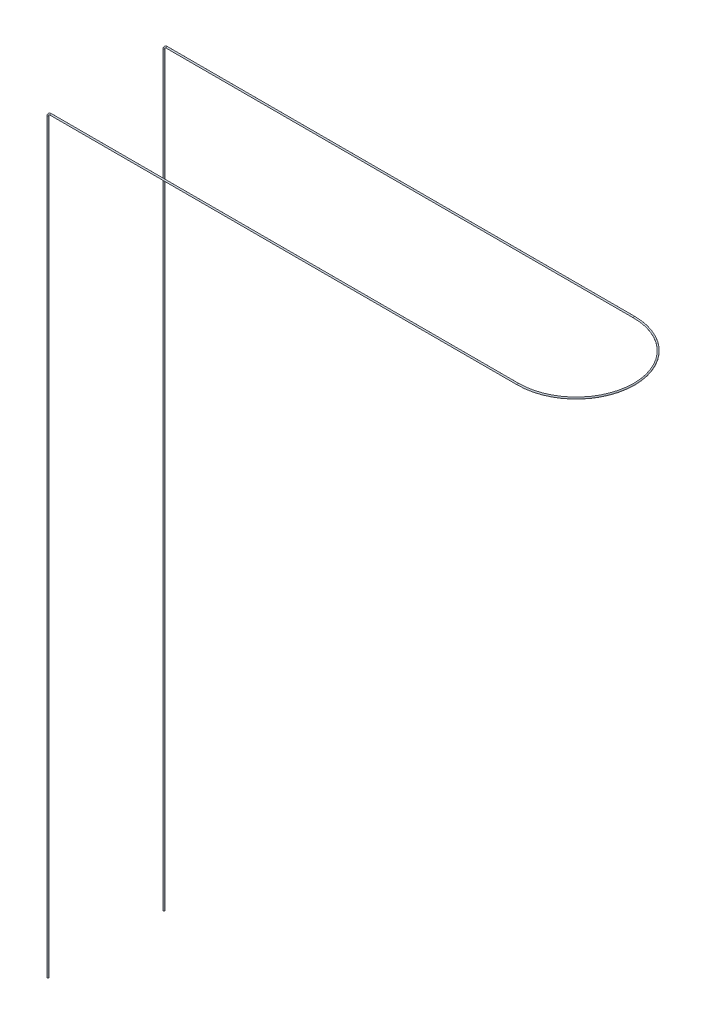
ISO-10303-21;
HEADER;
FILE_DESCRIPTION(('STEP AP214'),'2;1');
FILE_NAME('part.step','',(''),(''),'','','');
FILE_SCHEMA(('AUTOMOTIVE_DESIGN { 1 0 10303 214 1 1 1 1 }'));
ENDSEC;
DATA;
#1=APPLICATION_CONTEXT('core data for automotive mechanical design processes');
#2=APPLICATION_PROTOCOL_DEFINITION('international standard','automotive_design',2000,#1);
#3=PRODUCT_CONTEXT('',#1,'mechanical');
#4=PRODUCT('Part','Part','',(#3));
#5=PRODUCT_RELATED_PRODUCT_CATEGORY('part','',(#4));
#6=PRODUCT_DEFINITION_FORMATION('','',#4);
#7=PRODUCT_DEFINITION_CONTEXT('part definition',#1,'design');
#8=PRODUCT_DEFINITION('design','',#6,#7);
#9=PRODUCT_DEFINITION_SHAPE('','',#8);
#10=(LENGTH_UNIT() NAMED_UNIT(*) SI_UNIT(.MILLI.,.METRE.));
#11=(NAMED_UNIT(*) PLANE_ANGLE_UNIT() SI_UNIT($,.RADIAN.));
#12=(NAMED_UNIT(*) SI_UNIT($,.STERADIAN.) SOLID_ANGLE_UNIT());
#13=UNCERTAINTY_MEASURE_WITH_UNIT(LENGTH_MEASURE(1.E-05),#10,'distance_accuracy_value','');
#14=(GEOMETRIC_REPRESENTATION_CONTEXT(3) GLOBAL_UNCERTAINTY_ASSIGNED_CONTEXT((#13)) GLOBAL_UNIT_ASSIGNED_CONTEXT((#10,
#11,#12)) REPRESENTATION_CONTEXT('',''));
#15=CARTESIAN_POINT('',(0.,0.,0.));
#16=DIRECTION('',(0.,0.,1.));
#17=DIRECTION('',(1.,0.,0.));
#18=AXIS2_PLACEMENT_3D('',#15,#16,#17);
#19=CARTESIAN_POINT('',(0.,0.,0.));
#20=DIRECTION('',(0.,-1.,0.));
#21=DIRECTION('',(0.,0.,-1.));
#22=AXIS2_PLACEMENT_3D('',#19,#20,#21);
#23=PLANE('',#22);
#24=CARTESIAN_POINT('',(0.,0.,0.));
#25=DIRECTION('',(0.,-1.,0.));
#26=DIRECTION('',(0.,0.,-1.));
#27=AXIS2_PLACEMENT_3D('',#24,#25,#26);
#28=CIRCLE('',#27,0.25);
#29=CARTESIAN_POINT('',(0.,0.,-0.25));
#30=VERTEX_POINT('',#29);
#31=EDGE_CURVE('E85',#30,#30,#28,.T.);
#32=ORIENTED_EDGE('',*,*,#31,.T.);
#33=EDGE_LOOP('',(#32));
#34=FACE_BOUND('',#33,.T.);
#35=ADVANCED_FACE('F50',(#34),#23,.T.);
#36=CARTESIAN_POINT('',(0.,0.,-40.0000000000001));
#37=DIRECTION('',(0.,1.,0.));
#38=DIRECTION('',(0.,0.,1.));
#39=AXIS2_PLACEMENT_3D('',#36,#37,#38);
#40=PLANE('',#39);
#41=CARTESIAN_POINT('',(0.,0.,-40.0000000000001));
#42=DIRECTION('',(0.,1.,0.));
#43=DIRECTION('',(0.,0.,1.));
#44=AXIS2_PLACEMENT_3D('',#41,#42,#43);
#45=CIRCLE('',#44,0.25);
#46=CARTESIAN_POINT('',(0.,0.,-39.7500000000001));
#47=VERTEX_POINT('',#46);
#48=EDGE_CURVE('E11',#47,#47,#45,.T.);
#49=ORIENTED_EDGE('',*,*,#48,.F.);
#50=EDGE_LOOP('',(#49));
#51=FACE_BOUND('',#50,.T.);
#52=ADVANCED_FACE('F94',(#51),#40,.F.);
#53=CARTESIAN_POINT('',(0.,0.,0.));
#54=DIRECTION('',(0.,1.,0.));
#55=DIRECTION('',(-1.,0.,0.));
#56=AXIS2_PLACEMENT_3D('',#53,#54,#55);
#57=CYLINDRICAL_SURFACE('',#56,0.25);
#58=CARTESIAN_POINT('',(0.,257.,0.));
#59=DIRECTION('',(0.,-1.,0.));
#60=DIRECTION('',(0.,0.,-1.));
#61=AXIS2_PLACEMENT_3D('',#58,#59,#60);
#62=CIRCLE('',#61,0.25);
#63=CARTESIAN_POINT('',(-0.250000000000012,257.,0.));
#64=VERTEX_POINT('',#63);
#65=EDGE_CURVE('E81',#64,#64,#62,.T.);
#66=ORIENTED_EDGE('',*,*,#65,.T.);
#67=EDGE_LOOP('',(#66));
#68=FACE_BOUND('',#67,.T.);
#69=ORIENTED_EDGE('',*,*,#31,.F.);
#70=EDGE_LOOP('',(#69));
#71=FACE_BOUND('',#70,.T.);
#72=ADVANCED_FACE('F91',(#68,#71),#57,.T.);
#73=CARTESIAN_POINT('',(0.999999999999989,257.,0.));
#74=DIRECTION('',(0.,0.,-1.));
#75=DIRECTION('',(-1.,0.,0.));
#76=AXIS2_PLACEMENT_3D('',#73,#74,#75);
#77=TOROIDAL_SURFACE('',#76,1.,0.25);
#78=CARTESIAN_POINT('',(0.999999999999988,258.,0.));
#79=DIRECTION('',(-1.,0.,0.));
#80=DIRECTION('',(0.,0.,-1.));
#81=AXIS2_PLACEMENT_3D('',#78,#79,#80);
#82=CIRCLE('',#81,0.25);
#83=CARTESIAN_POINT('',(0.999999999999988,258.25,0.));
#84=VERTEX_POINT('',#83);
#85=EDGE_CURVE('E77',#84,#84,#82,.T.);
#86=CARTESIAN_POINT('',(0.999999999999989,257.,0.));
#87=DIRECTION('',(0.,0.,-1.));
#88=DIRECTION('',(-1.,0.,0.));
#89=AXIS2_PLACEMENT_3D('',#86,#87,#88);
#90=CIRCLE('',#89,1.25);
#91=EDGE_CURVE('',#64,#84,#90,.T.);
#92=ORIENTED_EDGE('',*,*,#65,.F.);
#93=ORIENTED_EDGE('',*,*,#85,.T.);
#94=ORIENTED_EDGE('',*,*,#91,.T.);
#95=ORIENTED_EDGE('',*,*,#91,.F.);
#96=EDGE_LOOP('',(#92,#94,#93,#95));
#97=FACE_BOUND('',#96,.T.);
#98=ADVANCED_FACE('F93',(#97),#77,.T.);
#99=CARTESIAN_POINT('',(0.999999999999989,258.,0.));
#100=DIRECTION('',(1.,0.,0.));
#101=DIRECTION('',(0.,1.,0.));
#102=AXIS2_PLACEMENT_3D('',#99,#100,#101);
#103=CYLINDRICAL_SURFACE('',#102,0.25);
#104=CARTESIAN_POINT('',(162.,258.,0.));
#105=DIRECTION('',(-1.,0.,0.));
#106=DIRECTION('',(0.,0.,-1.));
#107=AXIS2_PLACEMENT_3D('',#104,#105,#106);
#108=CIRCLE('',#107,0.25);
#109=CARTESIAN_POINT('',(162.,258.,0.249999999999993));
#110=VERTEX_POINT('',#109);
#111=EDGE_CURVE('E73',#110,#110,#108,.T.);
#112=ORIENTED_EDGE('',*,*,#111,.T.);
#113=EDGE_LOOP('',(#112));
#114=FACE_BOUND('',#113,.T.);
#115=ORIENTED_EDGE('',*,*,#85,.F.);
#116=EDGE_LOOP('',(#115));
#117=FACE_BOUND('',#116,.T.);
#118=ADVANCED_FACE('F101',(#114,#117),#103,.T.);
#119=CARTESIAN_POINT('',(162.,258.,-20.));
#120=DIRECTION('',(0.,1.,0.));
#121=DIRECTION('',(0.,0.,1.));
#122=AXIS2_PLACEMENT_3D('',#119,#120,#121);
#123=TOROIDAL_SURFACE('',#122,20.,0.25);
#124=CARTESIAN_POINT('',(162.,258.,-40.));
#125=DIRECTION('',(1.,0.,0.));
#126=DIRECTION('',(0.,0.,1.));
#127=AXIS2_PLACEMENT_3D('',#124,#125,#126);
#128=CIRCLE('',#127,0.25);
#129=CARTESIAN_POINT('',(162.,258.,-40.25));
#130=VERTEX_POINT('',#129);
#131=EDGE_CURVE('E67',#130,#130,#128,.T.);
#132=CARTESIAN_POINT('',(162.,258.,-20.));
#133=DIRECTION('',(0.,1.,0.));
#134=DIRECTION('',(0.,0.,1.));
#135=AXIS2_PLACEMENT_3D('',#132,#133,#134);
#136=CIRCLE('',#135,20.25);
#137=EDGE_CURVE('',#110,#130,#136,.T.);
#138=ORIENTED_EDGE('',*,*,#111,.F.);
#139=ORIENTED_EDGE('',*,*,#131,.T.);
#140=ORIENTED_EDGE('',*,*,#137,.T.);
#141=ORIENTED_EDGE('',*,*,#137,.F.);
#142=EDGE_LOOP('',(#138,#140,#139,#141));
#143=FACE_BOUND('',#142,.T.);
#144=ADVANCED_FACE('F118',(#143),#123,.T.);
#145=CARTESIAN_POINT('',(162.,258.,-40.));
#146=DIRECTION('',(-1.,0.,0.));
#147=DIRECTION('',(0.,-1.,0.));
#148=AXIS2_PLACEMENT_3D('',#145,#146,#147);
#149=CYLINDRICAL_SURFACE('',#148,0.25);
#150=CARTESIAN_POINT('',(1.,258.,-40.));
#151=DIRECTION('',(1.,0.,0.));
#152=DIRECTION('',(0.,0.,1.));
#153=AXIS2_PLACEMENT_3D('',#150,#151,#152);
#154=CIRCLE('',#153,0.25);
#155=CARTESIAN_POINT('',(1.,258.25,-40.));
#156=VERTEX_POINT('',#155);
#157=EDGE_CURVE('E62',#156,#156,#154,.T.);
#158=ORIENTED_EDGE('',*,*,#157,.T.);
#159=EDGE_LOOP('',(#158));
#160=FACE_BOUND('',#159,.T.);
#161=ORIENTED_EDGE('',*,*,#131,.F.);
#162=EDGE_LOOP('',(#161));
#163=FACE_BOUND('',#162,.T.);
#164=ADVANCED_FACE('F112',(#160,#163),#149,.T.);
#165=CARTESIAN_POINT('',(1.,257.,-40.));
#166=DIRECTION('',(0.,0.,1.));
#167=DIRECTION('',(1.,0.,0.));
#168=AXIS2_PLACEMENT_3D('',#165,#166,#167);
#169=TOROIDAL_SURFACE('',#168,1.,0.25);
#170=CARTESIAN_POINT('',(0.,257.,-40.));
#171=DIRECTION('',(0.,1.,0.));
#172=DIRECTION('',(0.,0.,1.));
#173=AXIS2_PLACEMENT_3D('',#170,#171,#172);
#174=CIRCLE('',#173,0.25);
#175=CARTESIAN_POINT('',(-0.25,257.,-40.));
#176=VERTEX_POINT('',#175);
#177=EDGE_CURVE('E57',#176,#176,#174,.T.);
#178=CARTESIAN_POINT('',(1.,257.,-40.));
#179=DIRECTION('',(0.,0.,1.));
#180=DIRECTION('',(1.,0.,0.));
#181=AXIS2_PLACEMENT_3D('',#178,#179,#180);
#182=CIRCLE('',#181,1.25);
#183=EDGE_CURVE('',#156,#176,#182,.T.);
#184=ORIENTED_EDGE('',*,*,#157,.F.);
#185=ORIENTED_EDGE('',*,*,#177,.T.);
#186=ORIENTED_EDGE('',*,*,#183,.T.);
#187=ORIENTED_EDGE('',*,*,#183,.F.);
#188=EDGE_LOOP('',(#184,#186,#185,#187));
#189=FACE_BOUND('',#188,.T.);
#190=ADVANCED_FACE('F107',(#189),#169,.T.);
#191=CARTESIAN_POINT('',(0.,257.,-40.));
#192=DIRECTION('',(0.,-1.,0.));
#193=DIRECTION('',(0.,0.,-1.));
#194=AXIS2_PLACEMENT_3D('',#191,#192,#193);
#195=CYLINDRICAL_SURFACE('',#194,0.25);
#196=ORIENTED_EDGE('',*,*,#48,.T.);
#197=EDGE_LOOP('',(#196));
#198=FACE_BOUND('',#197,.T.);
#199=ORIENTED_EDGE('',*,*,#177,.F.);
#200=EDGE_LOOP('',(#199));
#201=FACE_BOUND('',#200,.T.);
#202=ADVANCED_FACE('F105',(#198,#201),#195,.T.);
#203=CLOSED_SHELL('',(#35,#52,#72,#98,#118,#144,#164,#190,#202));
#204=MANIFOLD_SOLID_BREP('B2',#203);
#205=ADVANCED_BREP_SHAPE_REPRESENTATION('',(#18,#204),#14);
#206=SHAPE_DEFINITION_REPRESENTATION(#9,#205);
ENDSEC;
END-ISO-10303-21;
